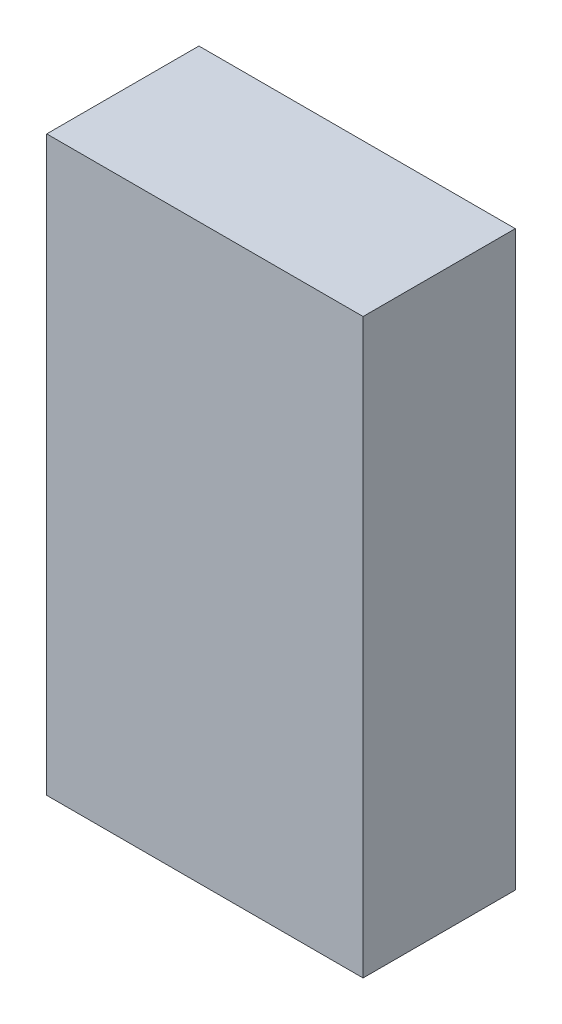
ISO-10303-21;
HEADER;
FILE_DESCRIPTION(('STEP AP214'),'2;1');
FILE_NAME('part.step','',(''),(''),'','','');
FILE_SCHEMA(('AUTOMOTIVE_DESIGN { 1 0 10303 214 1 1 1 1 }'));
ENDSEC;
DATA;
#1=APPLICATION_CONTEXT('core data for automotive mechanical design processes');
#2=APPLICATION_PROTOCOL_DEFINITION('international standard','automotive_design',2000,#1);
#3=PRODUCT_CONTEXT('',#1,'mechanical');
#4=PRODUCT('Part','Part','',(#3));
#5=PRODUCT_RELATED_PRODUCT_CATEGORY('part','',(#4));
#6=PRODUCT_DEFINITION_FORMATION('','',#4);
#7=PRODUCT_DEFINITION_CONTEXT('part definition',#1,'design');
#8=PRODUCT_DEFINITION('design','',#6,#7);
#9=PRODUCT_DEFINITION_SHAPE('','',#8);
#10=(LENGTH_UNIT() NAMED_UNIT(*) SI_UNIT(.MILLI.,.METRE.));
#11=(NAMED_UNIT(*) PLANE_ANGLE_UNIT() SI_UNIT($,.RADIAN.));
#12=(NAMED_UNIT(*) SI_UNIT($,.STERADIAN.) SOLID_ANGLE_UNIT());
#13=UNCERTAINTY_MEASURE_WITH_UNIT(LENGTH_MEASURE(1.E-05),#10,'distance_accuracy_value','');
#14=(GEOMETRIC_REPRESENTATION_CONTEXT(3) GLOBAL_UNCERTAINTY_ASSIGNED_CONTEXT((#13)) GLOBAL_UNIT_ASSIGNED_CONTEXT((#10,
#11,#12)) REPRESENTATION_CONTEXT('',''));
#15=CARTESIAN_POINT('',(0.,0.,0.));
#16=DIRECTION('',(0.,0.,1.));
#17=DIRECTION('',(1.,0.,0.));
#18=AXIS2_PLACEMENT_3D('',#15,#16,#17);
#19=CARTESIAN_POINT('',(-1.84999884,3.35000092,1.77999898));
#20=DIRECTION('',(0.,0.,-1.));
#21=DIRECTION('',(-1.,0.,0.));
#22=AXIS2_PLACEMENT_3D('',#19,#20,#21);
#23=PLANE('',#22);
#24=DIRECTION('',(1.,0.,0.));
#25=VECTOR('',#24,1.);
#26=CARTESIAN_POINT('',(-1.84999884,-3.34999838,1.77999898));
#27=LINE('',#26,#25);
#28=CARTESIAN_POINT('',(-1.84999884,-3.34999838,1.77999898));
#29=VERTEX_POINT('',#28);
#30=CARTESIAN_POINT('',(1.85000138,-3.34999838,1.77999898));
#31=VERTEX_POINT('',#30);
#32=EDGE_CURVE('E55',#29,#31,#27,.T.);
#33=ORIENTED_EDGE('',*,*,#32,.T.);
#34=DIRECTION('',(0.,1.,0.));
#35=VECTOR('',#34,1.);
#36=CARTESIAN_POINT('',(1.85000138,-3.34999838,1.77999898));
#37=LINE('',#36,#35);
#38=CARTESIAN_POINT('',(1.85000138,3.35000092,1.77999898));
#39=VERTEX_POINT('',#38);
#40=EDGE_CURVE('E57',#31,#39,#37,.T.);
#41=ORIENTED_EDGE('',*,*,#40,.T.);
#42=DIRECTION('',(1.,0.,0.));
#43=VECTOR('',#42,1.);
#44=CARTESIAN_POINT('',(1.85000138,3.35000092,1.77999898));
#45=LINE('',#44,#43);
#46=CARTESIAN_POINT('',(-1.84999884,3.35000092,1.77999898));
#47=VERTEX_POINT('',#46);
#48=EDGE_CURVE('E20',#39,#47,#45,.F.);
#49=ORIENTED_EDGE('',*,*,#48,.T.);
#50=DIRECTION('',(0.,1.,0.));
#51=VECTOR('',#50,1.);
#52=CARTESIAN_POINT('',(-1.84999884,3.35000092,1.77999898));
#53=LINE('',#52,#51);
#54=EDGE_CURVE('E80',#47,#29,#53,.F.);
#55=ORIENTED_EDGE('',*,*,#54,.T.);
#56=EDGE_LOOP('',(#33,#41,#49,#55));
#57=FACE_BOUND('',#56,.T.);
#58=ADVANCED_FACE('F17',(#57),#23,.F.);
#59=CARTESIAN_POINT('',(1.85000138,3.35000092,0.));
#60=DIRECTION('',(0.,-1.,0.));
#61=DIRECTION('',(0.,0.,-1.));
#62=AXIS2_PLACEMENT_3D('',#59,#60,#61);
#63=PLANE('',#62);
#64=DIRECTION('',(0.,0.,-1.));
#65=VECTOR('',#64,1.);
#66=CARTESIAN_POINT('',(-1.84999884,3.35000092,0.));
#67=LINE('',#66,#65);
#68=CARTESIAN_POINT('',(-1.84999884,3.35000092,0.));
#69=VERTEX_POINT('',#68);
#70=EDGE_CURVE('E68',#69,#47,#67,.F.);
#71=ORIENTED_EDGE('',*,*,#70,.T.);
#72=ORIENTED_EDGE('',*,*,#48,.F.);
#73=DIRECTION('',(0.,0.,1.));
#74=VECTOR('',#73,1.);
#75=CARTESIAN_POINT('',(1.85000138,3.35000092,0.));
#76=LINE('',#75,#74);
#77=CARTESIAN_POINT('',(1.85000138,3.35000092,0.));
#78=VERTEX_POINT('',#77);
#79=EDGE_CURVE('E63',#39,#78,#76,.F.);
#80=ORIENTED_EDGE('',*,*,#79,.T.);
#81=DIRECTION('',(-1.,0.,0.));
#82=VECTOR('',#81,1.);
#83=CARTESIAN_POINT('',(-1.84999884,3.35000092,0.));
#84=LINE('',#83,#82);
#85=EDGE_CURVE('E83',#69,#78,#84,.F.);
#86=ORIENTED_EDGE('',*,*,#85,.F.);
#87=EDGE_LOOP('',(#71,#72,#80,#86));
#88=FACE_BOUND('',#87,.T.);
#89=ADVANCED_FACE('F65',(#88),#63,.F.);
#90=CARTESIAN_POINT('',(1.85000138,-3.34999838,0.));
#91=DIRECTION('',(-1.,0.,0.));
#92=DIRECTION('',(0.,0.,1.));
#93=AXIS2_PLACEMENT_3D('',#90,#91,#92);
#94=PLANE('',#93);
#95=ORIENTED_EDGE('',*,*,#79,.F.);
#96=ORIENTED_EDGE('',*,*,#40,.F.);
#97=DIRECTION('',(0.,0.,1.));
#98=VECTOR('',#97,1.);
#99=CARTESIAN_POINT('',(1.85000138,-3.34999838,0.));
#100=LINE('',#99,#98);
#101=CARTESIAN_POINT('',(1.85000138,-3.34999838,0.));
#102=VERTEX_POINT('',#101);
#103=EDGE_CURVE('E75',#31,#102,#100,.F.);
#104=ORIENTED_EDGE('',*,*,#103,.T.);
#105=DIRECTION('',(0.,1.,0.));
#106=VECTOR('',#105,1.);
#107=CARTESIAN_POINT('',(1.85000138,3.35000092,0.));
#108=LINE('',#107,#106);
#109=EDGE_CURVE('E72',#78,#102,#108,.F.);
#110=ORIENTED_EDGE('',*,*,#109,.F.);
#111=EDGE_LOOP('',(#95,#96,#104,#110));
#112=FACE_BOUND('',#111,.T.);
#113=ADVANCED_FACE('F70',(#112),#94,.F.);
#114=CARTESIAN_POINT('',(-1.84999884,-3.34999838,0.));
#115=DIRECTION('',(0.,1.,0.));
#116=DIRECTION('',(0.,0.,1.));
#117=AXIS2_PLACEMENT_3D('',#114,#115,#116);
#118=PLANE('',#117);
#119=ORIENTED_EDGE('',*,*,#103,.F.);
#120=ORIENTED_EDGE('',*,*,#32,.F.);
#121=DIRECTION('',(0.,0.,-1.));
#122=VECTOR('',#121,1.);
#123=CARTESIAN_POINT('',(-1.84999884,-3.34999838,0.));
#124=LINE('',#123,#122);
#125=CARTESIAN_POINT('',(-1.84999884,-3.34999838,0.));
#126=VERTEX_POINT('',#125);
#127=EDGE_CURVE('E35',#29,#126,#124,.T.);
#128=ORIENTED_EDGE('',*,*,#127,.T.);
#129=DIRECTION('',(-1.,0.,0.));
#130=VECTOR('',#129,1.);
#131=CARTESIAN_POINT('',(-1.84999884,-3.34999838,0.));
#132=LINE('',#131,#130);
#133=EDGE_CURVE('E26',#102,#126,#132,.T.);
#134=ORIENTED_EDGE('',*,*,#133,.F.);
#135=EDGE_LOOP('',(#119,#120,#128,#134));
#136=FACE_BOUND('',#135,.T.);
#137=ADVANCED_FACE('F89',(#136),#118,.F.);
#138=CARTESIAN_POINT('',(-1.84999884,3.35000092,0.));
#139=DIRECTION('',(1.,0.,0.));
#140=DIRECTION('',(0.,0.,-1.));
#141=AXIS2_PLACEMENT_3D('',#138,#139,#140);
#142=PLANE('',#141);
#143=ORIENTED_EDGE('',*,*,#127,.F.);
#144=ORIENTED_EDGE('',*,*,#54,.F.);
#145=ORIENTED_EDGE('',*,*,#70,.F.);
#146=DIRECTION('',(0.,1.,0.));
#147=VECTOR('',#146,1.);
#148=CARTESIAN_POINT('',(-1.84999884,3.35000092,0.));
#149=LINE('',#148,#147);
#150=EDGE_CURVE('E11',#126,#69,#149,.T.);
#151=ORIENTED_EDGE('',*,*,#150,.F.);
#152=EDGE_LOOP('',(#143,#144,#145,#151));
#153=FACE_BOUND('',#152,.T.);
#154=ADVANCED_FACE('F91',(#153),#142,.F.);
#155=CARTESIAN_POINT('',(-1.84999884,3.35000092,0.));
#156=DIRECTION('',(0.,0.,-1.));
#157=DIRECTION('',(-1.,0.,0.));
#158=AXIS2_PLACEMENT_3D('',#155,#156,#157);
#159=PLANE('',#158);
#160=ORIENTED_EDGE('',*,*,#133,.T.);
#161=ORIENTED_EDGE('',*,*,#150,.T.);
#162=ORIENTED_EDGE('',*,*,#85,.T.);
#163=ORIENTED_EDGE('',*,*,#109,.T.);
#164=EDGE_LOOP('',(#160,#161,#162,#163));
#165=FACE_BOUND('',#164,.T.);
#166=ADVANCED_FACE('F88',(#165),#159,.T.);
#167=CLOSED_SHELL('',(#58,#89,#113,#137,#154,#166));
#168=MANIFOLD_SOLID_BREP('B1',#167);
#169=ADVANCED_BREP_SHAPE_REPRESENTATION('',(#18,#168),#14);
#170=SHAPE_DEFINITION_REPRESENTATION(#9,#169);
ENDSEC;
END-ISO-10303-21;
